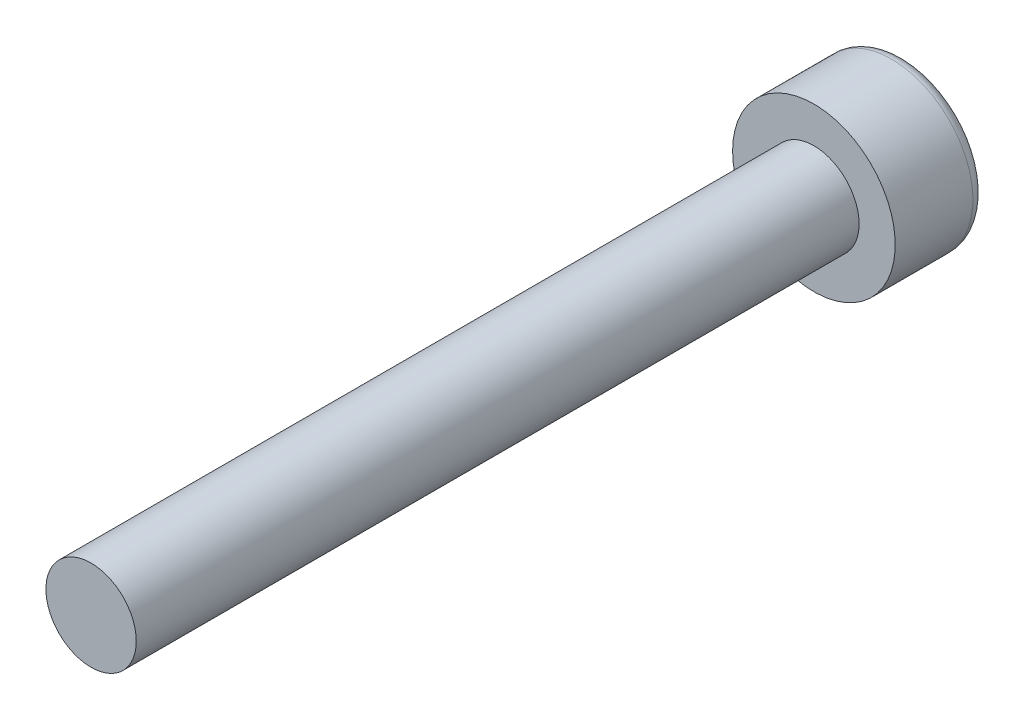
ISO-10303-21;
HEADER;
FILE_DESCRIPTION(('STEP AP214'),'2;1');
FILE_NAME('part.step','',(''),(''),'','','');
FILE_SCHEMA(('AUTOMOTIVE_DESIGN { 1 0 10303 214 1 1 1 1 }'));
ENDSEC;
DATA;
#1=APPLICATION_CONTEXT('core data for automotive mechanical design processes');
#2=APPLICATION_PROTOCOL_DEFINITION('international standard','automotive_design',2000,#1);
#3=PRODUCT_CONTEXT('',#1,'mechanical');
#4=PRODUCT('Part','Part','',(#3));
#5=PRODUCT_RELATED_PRODUCT_CATEGORY('part','',(#4));
#6=PRODUCT_DEFINITION_FORMATION('','',#4);
#7=PRODUCT_DEFINITION_CONTEXT('part definition',#1,'design');
#8=PRODUCT_DEFINITION('design','',#6,#7);
#9=PRODUCT_DEFINITION_SHAPE('','',#8);
#10=(LENGTH_UNIT() NAMED_UNIT(*) SI_UNIT(.MILLI.,.METRE.));
#11=(NAMED_UNIT(*) PLANE_ANGLE_UNIT() SI_UNIT($,.RADIAN.));
#12=(NAMED_UNIT(*) SI_UNIT($,.STERADIAN.) SOLID_ANGLE_UNIT());
#13=UNCERTAINTY_MEASURE_WITH_UNIT(LENGTH_MEASURE(1.E-05),#10,'distance_accuracy_value','');
#14=(GEOMETRIC_REPRESENTATION_CONTEXT(3) GLOBAL_UNCERTAINTY_ASSIGNED_CONTEXT((#13)) GLOBAL_UNIT_ASSIGNED_CONTEXT((#10,
#11,#12)) REPRESENTATION_CONTEXT('',''));
#15=CARTESIAN_POINT('',(0.,0.,0.));
#16=DIRECTION('',(0.,0.,1.));
#17=DIRECTION('',(1.,0.,0.));
#18=AXIS2_PLACEMENT_3D('',#15,#16,#17);
#19=CARTESIAN_POINT('',(0.,0.,20.));
#20=DIRECTION('',(0.,0.,-1.));
#21=DIRECTION('',(-1.,0.,0.));
#22=AXIS2_PLACEMENT_3D('',#19,#20,#21);
#23=CYLINDRICAL_SURFACE('',#22,1.25);
#24=CARTESIAN_POINT('',(0.,0.,20.));
#25=DIRECTION('',(0.,0.,1.));
#26=DIRECTION('',(1.,0.,0.));
#27=AXIS2_PLACEMENT_3D('',#24,#25,#26);
#28=CIRCLE('',#27,1.25);
#29=CARTESIAN_POINT('',(1.25,0.,20.));
#30=VERTEX_POINT('',#29);
#31=EDGE_CURVE('E143',#30,#30,#28,.T.);
#32=ORIENTED_EDGE('',*,*,#31,.F.);
#33=EDGE_LOOP('',(#32));
#34=FACE_BOUND('',#33,.T.);
#35=CARTESIAN_POINT('',(0.,0.,0.));
#36=DIRECTION('',(0.,0.,1.));
#37=DIRECTION('',(1.,0.,0.));
#38=AXIS2_PLACEMENT_3D('',#35,#36,#37);
#39=CIRCLE('',#38,1.25);
#40=CARTESIAN_POINT('',(1.25,0.,0.));
#41=VERTEX_POINT('',#40);
#42=EDGE_CURVE('E142',#41,#41,#39,.T.);
#43=ORIENTED_EDGE('',*,*,#42,.T.);
#44=EDGE_LOOP('',(#43));
#45=FACE_BOUND('',#44,.T.);
#46=ADVANCED_FACE('F32',(#34,#45),#23,.T.);
#47=CARTESIAN_POINT('',(0.,0.,20.));
#48=DIRECTION('',(0.,0.,1.));
#49=DIRECTION('',(1.,0.,0.));
#50=AXIS2_PLACEMENT_3D('',#47,#48,#49);
#51=PLANE('',#50);
#52=ORIENTED_EDGE('',*,*,#31,.T.);
#53=EDGE_LOOP('',(#52));
#54=FACE_BOUND('',#53,.T.);
#55=ADVANCED_FACE('F162',(#54),#51,.T.);
#56=CARTESIAN_POINT('',(0.,0.,-2.5));
#57=DIRECTION('',(0.,0.,1.));
#58=DIRECTION('',(1.,0.,0.));
#59=AXIS2_PLACEMENT_3D('',#56,#57,#58);
#60=CYLINDRICAL_SURFACE('',#59,2.25);
#61=CARTESIAN_POINT('',(0.,0.,-2.15));
#62=DIRECTION('',(0.,0.,-1.));
#63=DIRECTION('',(-1.,0.,0.));
#64=AXIS2_PLACEMENT_3D('',#61,#62,#63);
#65=CIRCLE('',#64,2.25);
#66=CARTESIAN_POINT('',(-2.25,0.,-2.15));
#67=VERTEX_POINT('',#66);
#68=EDGE_CURVE('E11',#67,#67,#65,.F.);
#69=ORIENTED_EDGE('',*,*,#68,.T.);
#70=EDGE_LOOP('',(#69));
#71=FACE_BOUND('',#70,.T.);
#72=CARTESIAN_POINT('',(0.,0.,0.));
#73=DIRECTION('',(0.,0.,-1.));
#74=DIRECTION('',(-1.,0.,0.));
#75=AXIS2_PLACEMENT_3D('',#72,#73,#74);
#76=CIRCLE('',#75,2.25);
#77=CARTESIAN_POINT('',(-2.25,0.,0.));
#78=VERTEX_POINT('',#77);
#79=EDGE_CURVE('E134',#78,#78,#76,.T.);
#80=ORIENTED_EDGE('',*,*,#79,.T.);
#81=EDGE_LOOP('',(#80));
#82=FACE_BOUND('',#81,.T.);
#83=ADVANCED_FACE('F167',(#71,#82),#60,.T.);
#84=CARTESIAN_POINT('',(0.,0.,-2.5));
#85=DIRECTION('',(0.,0.,-1.));
#86=DIRECTION('',(-1.,0.,0.));
#87=AXIS2_PLACEMENT_3D('',#84,#85,#86);
#88=PLANE('',#87);
#89=CARTESIAN_POINT('',(0.,0.,-2.5));
#90=DIRECTION('',(0.,0.,-1.));
#91=DIRECTION('',(-1.,0.,0.));
#92=AXIS2_PLACEMENT_3D('',#89,#90,#91);
#93=CIRCLE('',#92,1.9);
#94=CARTESIAN_POINT('',(-1.9,0.,-2.5));
#95=VERTEX_POINT('',#94);
#96=EDGE_CURVE('E40',#95,#95,#93,.T.);
#97=ORIENTED_EDGE('',*,*,#96,.T.);
#98=EDGE_LOOP('',(#97));
#99=FACE_BOUND('',#98,.T.);
#100=DIRECTION('',(-0.866025403784439,-0.5,0.));
#101=VECTOR('',#100,1.);
#102=CARTESIAN_POINT('',(1.,-0.577350269189626,-2.5));
#103=LINE('',#102,#101);
#104=CARTESIAN_POINT('',(1.,-0.577350269189626,-2.5));
#105=VERTEX_POINT('',#104);
#106=CARTESIAN_POINT('',(0.,-1.15470053837925,-2.5));
#107=VERTEX_POINT('',#106);
#108=EDGE_CURVE('E47',#105,#107,#103,.T.);
#109=ORIENTED_EDGE('',*,*,#108,.F.);
#110=DIRECTION('',(0.,-1.,0.));
#111=VECTOR('',#110,1.);
#112=CARTESIAN_POINT('',(1.,0.577350269189626,-2.5));
#113=LINE('',#112,#111);
#114=CARTESIAN_POINT('',(1.,0.577350269189626,-2.5));
#115=VERTEX_POINT('',#114);
#116=EDGE_CURVE('E130',#115,#105,#113,.T.);
#117=ORIENTED_EDGE('',*,*,#116,.F.);
#118=DIRECTION('',(0.866025403784439,-0.5,0.));
#119=VECTOR('',#118,1.);
#120=CARTESIAN_POINT('',(0.,1.15470053837925,-2.5));
#121=LINE('',#120,#119);
#122=CARTESIAN_POINT('',(0.,1.15470053837925,-2.5));
#123=VERTEX_POINT('',#122);
#124=EDGE_CURVE('E128',#123,#115,#121,.T.);
#125=ORIENTED_EDGE('',*,*,#124,.F.);
#126=DIRECTION('',(0.866025403784439,0.5,0.));
#127=VECTOR('',#126,1.);
#128=CARTESIAN_POINT('',(-1.,0.577350269189626,-2.5));
#129=LINE('',#128,#127);
#130=CARTESIAN_POINT('',(-1.,0.577350269189626,-2.5));
#131=VERTEX_POINT('',#130);
#132=EDGE_CURVE('E95',#131,#123,#129,.T.);
#133=ORIENTED_EDGE('',*,*,#132,.F.);
#134=DIRECTION('',(0.,1.,0.));
#135=VECTOR('',#134,1.);
#136=CARTESIAN_POINT('',(-1.,-0.577350269189626,-2.5));
#137=LINE('',#136,#135);
#138=CARTESIAN_POINT('',(-1.,-0.577350269189626,-2.5));
#139=VERTEX_POINT('',#138);
#140=EDGE_CURVE('E124',#139,#131,#137,.T.);
#141=ORIENTED_EDGE('',*,*,#140,.F.);
#142=DIRECTION('',(-0.866025403784438,0.5,0.));
#143=VECTOR('',#142,1.);
#144=CARTESIAN_POINT('',(0.,-1.15470053837925,-2.5));
#145=LINE('',#144,#143);
#146=EDGE_CURVE('E121',#107,#139,#145,.T.);
#147=ORIENTED_EDGE('',*,*,#146,.F.);
#148=EDGE_LOOP('',(#109,#117,#125,#133,#141,#147));
#149=FACE_BOUND('',#148,.T.);
#150=ADVANCED_FACE('F150',(#99,#149),#88,.T.);
#151=CARTESIAN_POINT('',(0.,0.,0.));
#152=DIRECTION('',(0.,0.,-1.));
#153=DIRECTION('',(-1.,0.,0.));
#154=AXIS2_PLACEMENT_3D('',#151,#152,#153);
#155=PLANE('',#154);
#156=ORIENTED_EDGE('',*,*,#42,.F.);
#157=EDGE_LOOP('',(#156));
#158=FACE_BOUND('',#157,.T.);
#159=ORIENTED_EDGE('',*,*,#79,.F.);
#160=EDGE_LOOP('',(#159));
#161=FACE_BOUND('',#160,.T.);
#162=ADVANCED_FACE('F176',(#158,#161),#155,.F.);
#163=CARTESIAN_POINT('',(1.,-0.577350269189626,-1.));
#164=DIRECTION('',(0.5,-0.866025403784438,0.));
#165=DIRECTION('',(0.866025403784439,0.5,0.));
#166=AXIS2_PLACEMENT_3D('',#163,#164,#165);
#167=PLANE('',#166);
#168=ORIENTED_EDGE('',*,*,#108,.T.);
#169=DIRECTION('',(0.,0.,-1.));
#170=VECTOR('',#169,1.);
#171=CARTESIAN_POINT('',(0.,-1.15470053837925,-1.));
#172=LINE('',#171,#170);
#173=CARTESIAN_POINT('',(0.,-1.15470053837925,-1.));
#174=VERTEX_POINT('',#173);
#175=EDGE_CURVE('E77',#174,#107,#172,.T.);
#176=ORIENTED_EDGE('',*,*,#175,.F.);
#177=DIRECTION('',(-0.866025403784439,-0.5,0.));
#178=VECTOR('',#177,1.);
#179=CARTESIAN_POINT('',(1.,-0.577350269189626,-1.));
#180=LINE('',#179,#178);
#181=CARTESIAN_POINT('',(1.,-0.577350269189626,-1.));
#182=VERTEX_POINT('',#181);
#183=EDGE_CURVE('E132',#182,#174,#180,.T.);
#184=ORIENTED_EDGE('',*,*,#183,.F.);
#185=DIRECTION('',(0.,0.,-1.));
#186=VECTOR('',#185,1.);
#187=CARTESIAN_POINT('',(1.,-0.577350269189626,-1.));
#188=LINE('',#187,#186);
#189=EDGE_CURVE('E55',#182,#105,#188,.T.);
#190=ORIENTED_EDGE('',*,*,#189,.T.);
#191=EDGE_LOOP('',(#168,#176,#184,#190));
#192=FACE_BOUND('',#191,.T.);
#193=ADVANCED_FACE('F179',(#192),#167,.F.);
#194=CARTESIAN_POINT('',(1.,0.577350269189626,-1.));
#195=DIRECTION('',(1.,0.,0.));
#196=DIRECTION('',(0.,1.,0.));
#197=AXIS2_PLACEMENT_3D('',#194,#195,#196);
#198=PLANE('',#197);
#199=ORIENTED_EDGE('',*,*,#116,.T.);
#200=ORIENTED_EDGE('',*,*,#189,.F.);
#201=DIRECTION('',(0.,-1.,0.));
#202=VECTOR('',#201,1.);
#203=CARTESIAN_POINT('',(1.,0.577350269189626,-1.));
#204=LINE('',#203,#202);
#205=CARTESIAN_POINT('',(1.,0.577350269189626,-1.));
#206=VERTEX_POINT('',#205);
#207=EDGE_CURVE('E107',#206,#182,#204,.T.);
#208=ORIENTED_EDGE('',*,*,#207,.F.);
#209=DIRECTION('',(0.,0.,-1.));
#210=VECTOR('',#209,1.);
#211=CARTESIAN_POINT('',(1.,0.577350269189626,-1.));
#212=LINE('',#211,#210);
#213=EDGE_CURVE('E99',#206,#115,#212,.T.);
#214=ORIENTED_EDGE('',*,*,#213,.T.);
#215=EDGE_LOOP('',(#199,#200,#208,#214));
#216=FACE_BOUND('',#215,.T.);
#217=ADVANCED_FACE('F185',(#216),#198,.F.);
#218=CARTESIAN_POINT('',(0.,1.15470053837925,-1.));
#219=DIRECTION('',(0.5,0.866025403784439,0.));
#220=DIRECTION('',(-0.866025403784439,0.5,0.));
#221=AXIS2_PLACEMENT_3D('',#218,#219,#220);
#222=PLANE('',#221);
#223=ORIENTED_EDGE('',*,*,#124,.T.);
#224=ORIENTED_EDGE('',*,*,#213,.F.);
#225=DIRECTION('',(0.866025403784439,-0.5,0.));
#226=VECTOR('',#225,1.);
#227=CARTESIAN_POINT('',(0.,1.15470053837925,-1.));
#228=LINE('',#227,#226);
#229=CARTESIAN_POINT('',(0.,1.15470053837925,-1.));
#230=VERTEX_POINT('',#229);
#231=EDGE_CURVE('E103',#230,#206,#228,.T.);
#232=ORIENTED_EDGE('',*,*,#231,.F.);
#233=DIRECTION('',(0.,0.,-1.));
#234=VECTOR('',#233,1.);
#235=CARTESIAN_POINT('',(0.,1.15470053837925,-1.));
#236=LINE('',#235,#234);
#237=EDGE_CURVE('E88',#230,#123,#236,.T.);
#238=ORIENTED_EDGE('',*,*,#237,.T.);
#239=EDGE_LOOP('',(#223,#224,#232,#238));
#240=FACE_BOUND('',#239,.T.);
#241=ADVANCED_FACE('F104',(#240),#222,.F.);
#242=CARTESIAN_POINT('',(-1.,0.577350269189626,-1.));
#243=DIRECTION('',(-0.5,0.866025403784439,0.));
#244=DIRECTION('',(-0.866025403784439,-0.5,0.));
#245=AXIS2_PLACEMENT_3D('',#242,#243,#244);
#246=PLANE('',#245);
#247=ORIENTED_EDGE('',*,*,#132,.T.);
#248=ORIENTED_EDGE('',*,*,#237,.F.);
#249=DIRECTION('',(0.866025403784439,0.5,0.));
#250=VECTOR('',#249,1.);
#251=CARTESIAN_POINT('',(-1.,0.577350269189626,-1.));
#252=LINE('',#251,#250);
#253=CARTESIAN_POINT('',(-1.,0.577350269189626,-1.));
#254=VERTEX_POINT('',#253);
#255=EDGE_CURVE('E92',#254,#230,#252,.T.);
#256=ORIENTED_EDGE('',*,*,#255,.F.);
#257=DIRECTION('',(0.,0.,-1.));
#258=VECTOR('',#257,1.);
#259=CARTESIAN_POINT('',(-1.,0.577350269189626,-1.));
#260=LINE('',#259,#258);
#261=EDGE_CURVE('E100',#254,#131,#260,.T.);
#262=ORIENTED_EDGE('',*,*,#261,.T.);
#263=EDGE_LOOP('',(#247,#248,#256,#262));
#264=FACE_BOUND('',#263,.T.);
#265=ADVANCED_FACE('F90',(#264),#246,.F.);
#266=CARTESIAN_POINT('',(-1.,-0.577350269189626,-1.));
#267=DIRECTION('',(-1.,0.,0.));
#268=DIRECTION('',(0.,0.,1.));
#269=AXIS2_PLACEMENT_3D('',#266,#267,#268);
#270=PLANE('',#269);
#271=ORIENTED_EDGE('',*,*,#140,.T.);
#272=ORIENTED_EDGE('',*,*,#261,.F.);
#273=DIRECTION('',(0.,1.,0.));
#274=VECTOR('',#273,1.);
#275=CARTESIAN_POINT('',(-1.,-0.577350269189626,-1.));
#276=LINE('',#275,#274);
#277=CARTESIAN_POINT('',(-1.,-0.577350269189626,-1.));
#278=VERTEX_POINT('',#277);
#279=EDGE_CURVE('E113',#278,#254,#276,.T.);
#280=ORIENTED_EDGE('',*,*,#279,.F.);
#281=DIRECTION('',(0.,0.,-1.));
#282=VECTOR('',#281,1.);
#283=CARTESIAN_POINT('',(-1.,-0.577350269189626,-1.));
#284=LINE('',#283,#282);
#285=EDGE_CURVE('E137',#278,#139,#284,.T.);
#286=ORIENTED_EDGE('',*,*,#285,.T.);
#287=EDGE_LOOP('',(#271,#272,#280,#286));
#288=FACE_BOUND('',#287,.T.);
#289=ADVANCED_FACE('F188',(#288),#270,.F.);
#290=CARTESIAN_POINT('',(0.,-1.15470053837925,-1.));
#291=DIRECTION('',(-0.5,-0.866025403784439,0.));
#292=DIRECTION('',(0.866025403784439,-0.5,0.));
#293=AXIS2_PLACEMENT_3D('',#290,#291,#292);
#294=PLANE('',#293);
#295=ORIENTED_EDGE('',*,*,#146,.T.);
#296=ORIENTED_EDGE('',*,*,#285,.F.);
#297=DIRECTION('',(-0.866025403784438,0.5,0.));
#298=VECTOR('',#297,1.);
#299=CARTESIAN_POINT('',(0.,-1.15470053837925,-1.));
#300=LINE('',#299,#298);
#301=EDGE_CURVE('E115',#174,#278,#300,.T.);
#302=ORIENTED_EDGE('',*,*,#301,.F.);
#303=ORIENTED_EDGE('',*,*,#175,.T.);
#304=EDGE_LOOP('',(#295,#296,#302,#303));
#305=FACE_BOUND('',#304,.T.);
#306=ADVANCED_FACE('F158',(#305),#294,.F.);
#307=CARTESIAN_POINT('',(0.,0.,-1.));
#308=DIRECTION('',(0.,0.,-1.));
#309=DIRECTION('',(-1.,0.,0.));
#310=AXIS2_PLACEMENT_3D('',#307,#308,#309);
#311=PLANE('',#310);
#312=ORIENTED_EDGE('',*,*,#183,.T.);
#313=ORIENTED_EDGE('',*,*,#301,.T.);
#314=ORIENTED_EDGE('',*,*,#279,.T.);
#315=ORIENTED_EDGE('',*,*,#255,.T.);
#316=ORIENTED_EDGE('',*,*,#231,.T.);
#317=ORIENTED_EDGE('',*,*,#207,.T.);
#318=EDGE_LOOP('',(#312,#313,#314,#315,#316,#317));
#319=FACE_BOUND('',#318,.T.);
#320=ADVANCED_FACE('F110',(#319),#311,.T.);
#321=CARTESIAN_POINT('',(0.,0.,-2.15));
#322=DIRECTION('',(0.,0.,-1.));
#323=DIRECTION('',(-1.,0.,0.));
#324=AXIS2_PLACEMENT_3D('',#321,#322,#323);
#325=TOROIDAL_SURFACE('',#324,1.9,0.35);
#326=ORIENTED_EDGE('',*,*,#68,.F.);
#327=EDGE_LOOP('',(#326));
#328=FACE_BOUND('',#327,.T.);
#329=ORIENTED_EDGE('',*,*,#96,.F.);
#330=EDGE_LOOP('',(#329));
#331=FACE_BOUND('',#330,.T.);
#332=ADVANCED_FACE('F34',(#328,#331),#325,.T.);
#333=CLOSED_SHELL('',(#46,#55,#83,#150,#162,#193,#217,#241,#265,#289,#306,#320,#332));
#334=MANIFOLD_SOLID_BREP('B2',#333);
#335=ADVANCED_BREP_SHAPE_REPRESENTATION('',(#18,#334),#14);
#336=SHAPE_DEFINITION_REPRESENTATION(#9,#335);
ENDSEC;
END-ISO-10303-21;
